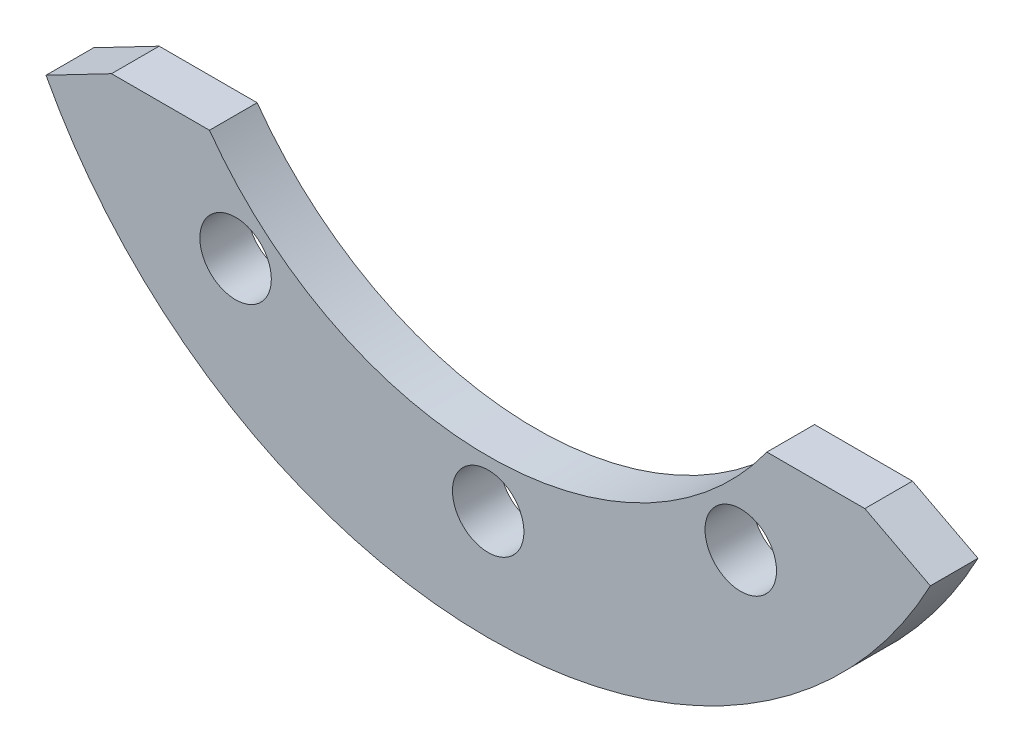
ISO-10303-21;
HEADER;
FILE_DESCRIPTION(('STEP AP214'),'2;1');
FILE_NAME('part.step','',(''),(''),'','','');
FILE_SCHEMA(('AUTOMOTIVE_DESIGN { 1 0 10303 214 1 1 1 1 }'));
ENDSEC;
DATA;
#1=APPLICATION_CONTEXT('core data for automotive mechanical design processes');
#2=APPLICATION_PROTOCOL_DEFINITION('international standard','automotive_design',2000,#1);
#3=PRODUCT_CONTEXT('',#1,'mechanical');
#4=PRODUCT('Part','Part','',(#3));
#5=PRODUCT_RELATED_PRODUCT_CATEGORY('part','',(#4));
#6=PRODUCT_DEFINITION_FORMATION('','',#4);
#7=PRODUCT_DEFINITION_CONTEXT('part definition',#1,'design');
#8=PRODUCT_DEFINITION('design','',#6,#7);
#9=PRODUCT_DEFINITION_SHAPE('','',#8);
#10=(LENGTH_UNIT() NAMED_UNIT(*) SI_UNIT(.MILLI.,.METRE.));
#11=(NAMED_UNIT(*) PLANE_ANGLE_UNIT() SI_UNIT($,.RADIAN.));
#12=(NAMED_UNIT(*) SI_UNIT($,.STERADIAN.) SOLID_ANGLE_UNIT());
#13=UNCERTAINTY_MEASURE_WITH_UNIT(LENGTH_MEASURE(1.E-05),#10,'distance_accuracy_value','');
#14=(GEOMETRIC_REPRESENTATION_CONTEXT(3) GLOBAL_UNCERTAINTY_ASSIGNED_CONTEXT((#13)) GLOBAL_UNIT_ASSIGNED_CONTEXT((#10,
#11,#12)) REPRESENTATION_CONTEXT('',''));
#15=CARTESIAN_POINT('',(0.,0.,0.));
#16=DIRECTION('',(0.,0.,1.));
#17=DIRECTION('',(1.,0.,0.));
#18=AXIS2_PLACEMENT_3D('',#15,#16,#17);
#19=CARTESIAN_POINT('',(5.84807660688538,-4.2,-1.));
#20=DIRECTION('',(0.,1.,0.));
#21=DIRECTION('',(0.,0.,1.));
#22=AXIS2_PLACEMENT_3D('',#19,#20,#21);
#23=PLANE('',#22);
#24=DIRECTION('',(-1.,0.,0.));
#25=VECTOR('',#24,1.);
#26=CARTESIAN_POINT('',(5.84807660688538,-4.2,0.));
#27=LINE('',#26,#25);
#28=CARTESIAN_POINT('',(7.90332208631282,-4.2,0.));
#29=VERTEX_POINT('',#28);
#30=CARTESIAN_POINT('',(5.84807660688538,-4.2,0.));
#31=VERTEX_POINT('',#30);
#32=EDGE_CURVE('E99',#29,#31,#27,.T.);
#33=ORIENTED_EDGE('',*,*,#32,.F.);
#34=DIRECTION('',(0.,0.,1.));
#35=VECTOR('',#34,1.);
#36=CARTESIAN_POINT('',(7.90332208631282,-4.2,-1.));
#37=LINE('',#36,#35);
#38=CARTESIAN_POINT('',(7.90332208631282,-4.2,-1.));
#39=VERTEX_POINT('',#38);
#40=EDGE_CURVE('E49',#39,#29,#37,.T.);
#41=ORIENTED_EDGE('',*,*,#40,.F.);
#42=DIRECTION('',(-1.,0.,0.));
#43=VECTOR('',#42,1.);
#44=CARTESIAN_POINT('',(5.84807660688538,-4.2,-1.));
#45=LINE('',#44,#43);
#46=CARTESIAN_POINT('',(5.84807660688538,-4.2,-1.));
#47=VERTEX_POINT('',#46);
#48=EDGE_CURVE('E97',#39,#47,#45,.T.);
#49=ORIENTED_EDGE('',*,*,#48,.T.);
#50=DIRECTION('',(0.,0.,1.));
#51=VECTOR('',#50,1.);
#52=CARTESIAN_POINT('',(5.84807660688538,-4.2,-1.));
#53=LINE('',#52,#51);
#54=EDGE_CURVE('E11',#47,#31,#53,.T.);
#55=ORIENTED_EDGE('',*,*,#54,.T.);
#56=EDGE_LOOP('',(#33,#41,#49,#55));
#57=FACE_BOUND('',#56,.T.);
#58=ADVANCED_FACE('F34',(#57),#23,.T.);
#59=CARTESIAN_POINT('',(0.,0.,-1.));
#60=DIRECTION('',(0.,0.,1.));
#61=DIRECTION('',(1.,0.,0.));
#62=AXIS2_PLACEMENT_3D('',#59,#60,#61);
#63=CYLINDRICAL_SURFACE('',#62,10.5);
#64=CARTESIAN_POINT('',(0.,0.,-1.));
#65=DIRECTION('',(0.,0.,1.));
#66=DIRECTION('',(1.,0.,0.));
#67=AXIS2_PLACEMENT_3D('',#64,#65,#66);
#68=CIRCLE('',#67,10.5);
#69=CARTESIAN_POINT('',(-9.27823124000227,-4.91573240291271,-1.));
#70=VERTEX_POINT('',#69);
#71=CARTESIAN_POINT('',(9.27823124000227,-4.91573240291271,-1.));
#72=VERTEX_POINT('',#71);
#73=EDGE_CURVE('E106',#70,#72,#68,.T.);
#74=ORIENTED_EDGE('',*,*,#73,.T.);
#75=DIRECTION('',(0.,0.,1.));
#76=VECTOR('',#75,1.);
#77=CARTESIAN_POINT('',(9.27823124000227,-4.91573240291271,-1.));
#78=LINE('',#77,#76);
#79=CARTESIAN_POINT('',(9.27823124000227,-4.91573240291271,0.));
#80=VERTEX_POINT('',#79);
#81=EDGE_CURVE('E88',#72,#80,#78,.T.);
#82=ORIENTED_EDGE('',*,*,#81,.T.);
#83=CARTESIAN_POINT('',(0.,0.,0.));
#84=DIRECTION('',(0.,0.,1.));
#85=DIRECTION('',(1.,0.,0.));
#86=AXIS2_PLACEMENT_3D('',#83,#84,#85);
#87=CIRCLE('',#86,10.5);
#88=CARTESIAN_POINT('',(-9.27823124000227,-4.91573240291271,0.));
#89=VERTEX_POINT('',#88);
#90=EDGE_CURVE('E119',#89,#80,#87,.T.);
#91=ORIENTED_EDGE('',*,*,#90,.F.);
#92=DIRECTION('',(0.,0.,1.));
#93=VECTOR('',#92,1.);
#94=CARTESIAN_POINT('',(-9.27823124000227,-4.91573240291271,-1.));
#95=LINE('',#94,#93);
#96=EDGE_CURVE('E57',#70,#89,#95,.T.);
#97=ORIENTED_EDGE('',*,*,#96,.F.);
#98=EDGE_LOOP('',(#74,#82,#91,#97));
#99=FACE_BOUND('',#98,.T.);
#100=ADVANCED_FACE('F157',(#99),#63,.T.);
#101=CARTESIAN_POINT('',(0.,0.,-1.));
#102=DIRECTION('',(0.,0.,1.));
#103=DIRECTION('',(1.,0.,0.));
#104=AXIS2_PLACEMENT_3D('',#101,#102,#103);
#105=PLANE('',#104);
#106=CARTESIAN_POINT('',(5.3,-6.25699608438426,-1.));
#107=DIRECTION('',(0.,0.,1.));
#108=DIRECTION('',(1.,0.,0.));
#109=AXIS2_PLACEMENT_3D('',#106,#107,#108);
#110=CIRCLE('',#109,0.75);
#111=CARTESIAN_POINT('',(6.05,-6.25699608438426,-1.));
#112=VERTEX_POINT('',#111);
#113=EDGE_CURVE('E116',#112,#112,#110,.T.);
#114=ORIENTED_EDGE('',*,*,#113,.T.);
#115=EDGE_LOOP('',(#114));
#116=FACE_BOUND('',#115,.T.);
#117=CARTESIAN_POINT('',(-5.3,-6.25699608438426,-1.));
#118=DIRECTION('',(0.,0.,1.));
#119=DIRECTION('',(1.,0.,0.));
#120=AXIS2_PLACEMENT_3D('',#117,#118,#119);
#121=CIRCLE('',#120,0.75);
#122=CARTESIAN_POINT('',(-4.55,-6.25699608438426,-1.));
#123=VERTEX_POINT('',#122);
#124=EDGE_CURVE('E132',#123,#123,#121,.T.);
#125=ORIENTED_EDGE('',*,*,#124,.T.);
#126=EDGE_LOOP('',(#125));
#127=FACE_BOUND('',#126,.T.);
#128=CARTESIAN_POINT('',(0.,-8.2,-1.));
#129=DIRECTION('',(0.,0.,1.));
#130=DIRECTION('',(1.,0.,0.));
#131=AXIS2_PLACEMENT_3D('',#128,#129,#130);
#132=CIRCLE('',#131,0.75);
#133=CARTESIAN_POINT('',(0.75,-8.2,-1.));
#134=VERTEX_POINT('',#133);
#135=EDGE_CURVE('E138',#134,#134,#132,.T.);
#136=ORIENTED_EDGE('',*,*,#135,.T.);
#137=EDGE_LOOP('',(#136));
#138=FACE_BOUND('',#137,.T.);
#139=DIRECTION('',(-0.887010833178223,0.461748613235031,0.));
#140=VECTOR('',#139,1.);
#141=CARTESIAN_POINT('',(7.90332208631282,-4.2,-1.));
#142=LINE('',#141,#140);
#143=EDGE_CURVE('E85',#72,#39,#142,.T.);
#144=ORIENTED_EDGE('',*,*,#143,.F.);
#145=ORIENTED_EDGE('',*,*,#73,.F.);
#146=DIRECTION('',(0.887010833178223,0.461748613235031,0.));
#147=VECTOR('',#146,1.);
#148=CARTESIAN_POINT('',(-7.90332208631282,-4.2,-1.));
#149=LINE('',#148,#147);
#150=CARTESIAN_POINT('',(-7.90332208631282,-4.2,-1.));
#151=VERTEX_POINT('',#150);
#152=EDGE_CURVE('E146',#70,#151,#149,.T.);
#153=ORIENTED_EDGE('',*,*,#152,.T.);
#154=DIRECTION('',(-1.,0.,0.));
#155=VECTOR('',#154,1.);
#156=CARTESIAN_POINT('',(-9.62340895940726,-4.2,-1.));
#157=LINE('',#156,#155);
#158=CARTESIAN_POINT('',(-5.84807660688538,-4.2,-1.));
#159=VERTEX_POINT('',#158);
#160=EDGE_CURVE('E108',#159,#151,#157,.T.);
#161=ORIENTED_EDGE('',*,*,#160,.F.);
#162=CARTESIAN_POINT('',(0.,0.,-1.));
#163=DIRECTION('',(0.,0.,-1.));
#164=DIRECTION('',(1.,0.,0.));
#165=AXIS2_PLACEMENT_3D('',#162,#163,#164);
#166=CIRCLE('',#165,7.2);
#167=EDGE_CURVE('E105',#47,#159,#166,.T.);
#168=ORIENTED_EDGE('',*,*,#167,.F.);
#169=ORIENTED_EDGE('',*,*,#48,.F.);
#170=EDGE_LOOP('',(#144,#145,#153,#161,#168,#169));
#171=FACE_BOUND('',#170,.T.);
#172=ADVANCED_FACE('F102',(#116,#127,#138,#171),#105,.F.);
#173=CARTESIAN_POINT('',(0.,0.,0.));
#174=DIRECTION('',(0.,0.,1.));
#175=DIRECTION('',(1.,0.,0.));
#176=AXIS2_PLACEMENT_3D('',#173,#174,#175);
#177=PLANE('',#176);
#178=CARTESIAN_POINT('',(0.,-8.2,0.));
#179=DIRECTION('',(0.,0.,1.));
#180=DIRECTION('',(1.,0.,0.));
#181=AXIS2_PLACEMENT_3D('',#178,#179,#180);
#182=CIRCLE('',#181,0.75);
#183=CARTESIAN_POINT('',(0.75,-8.2,0.));
#184=VERTEX_POINT('',#183);
#185=EDGE_CURVE('E141',#184,#184,#182,.T.);
#186=ORIENTED_EDGE('',*,*,#185,.F.);
#187=EDGE_LOOP('',(#186));
#188=FACE_BOUND('',#187,.T.);
#189=CARTESIAN_POINT('',(-5.3,-6.25699608438426,0.));
#190=DIRECTION('',(0.,0.,1.));
#191=DIRECTION('',(1.,0.,0.));
#192=AXIS2_PLACEMENT_3D('',#189,#190,#191);
#193=CIRCLE('',#192,0.75);
#194=CARTESIAN_POINT('',(-4.55,-6.25699608438426,0.));
#195=VERTEX_POINT('',#194);
#196=EDGE_CURVE('E135',#195,#195,#193,.T.);
#197=ORIENTED_EDGE('',*,*,#196,.F.);
#198=EDGE_LOOP('',(#197));
#199=FACE_BOUND('',#198,.T.);
#200=CARTESIAN_POINT('',(5.3,-6.25699608438426,0.));
#201=DIRECTION('',(0.,0.,1.));
#202=DIRECTION('',(1.,0.,0.));
#203=AXIS2_PLACEMENT_3D('',#200,#201,#202);
#204=CIRCLE('',#203,0.75);
#205=CARTESIAN_POINT('',(6.05,-6.25699608438426,0.));
#206=VERTEX_POINT('',#205);
#207=EDGE_CURVE('E129',#206,#206,#204,.T.);
#208=ORIENTED_EDGE('',*,*,#207,.F.);
#209=EDGE_LOOP('',(#208));
#210=FACE_BOUND('',#209,.T.);
#211=ORIENTED_EDGE('',*,*,#90,.T.);
#212=DIRECTION('',(-0.887010833178223,0.461748613235031,0.));
#213=VECTOR('',#212,1.);
#214=CARTESIAN_POINT('',(7.90332208631282,-4.2,0.));
#215=LINE('',#214,#213);
#216=EDGE_CURVE('E93',#80,#29,#215,.T.);
#217=ORIENTED_EDGE('',*,*,#216,.T.);
#218=ORIENTED_EDGE('',*,*,#32,.T.);
#219=CARTESIAN_POINT('',(0.,0.,0.));
#220=DIRECTION('',(0.,0.,-1.));
#221=DIRECTION('',(1.,0.,0.));
#222=AXIS2_PLACEMENT_3D('',#219,#220,#221);
#223=CIRCLE('',#222,7.2);
#224=CARTESIAN_POINT('',(-5.84807660688538,-4.2,0.));
#225=VERTEX_POINT('',#224);
#226=EDGE_CURVE('E112',#31,#225,#223,.T.);
#227=ORIENTED_EDGE('',*,*,#226,.T.);
#228=DIRECTION('',(-1.,0.,0.));
#229=VECTOR('',#228,1.);
#230=CARTESIAN_POINT('',(-9.62340895940726,-4.2,0.));
#231=LINE('',#230,#229);
#232=CARTESIAN_POINT('',(-7.90332208631282,-4.2,0.));
#233=VERTEX_POINT('',#232);
#234=EDGE_CURVE('E115',#225,#233,#231,.T.);
#235=ORIENTED_EDGE('',*,*,#234,.T.);
#236=DIRECTION('',(0.887010833178223,0.461748613235031,0.));
#237=VECTOR('',#236,1.);
#238=CARTESIAN_POINT('',(-7.90332208631282,-4.2,0.));
#239=LINE('',#238,#237);
#240=EDGE_CURVE('E149',#89,#233,#239,.T.);
#241=ORIENTED_EDGE('',*,*,#240,.F.);
#242=EDGE_LOOP('',(#211,#217,#218,#227,#235,#241));
#243=FACE_BOUND('',#242,.T.);
#244=ADVANCED_FACE('F154',(#188,#199,#210,#243),#177,.T.);
#245=CARTESIAN_POINT('',(0.,0.,-1.));
#246=DIRECTION('',(0.,0.,1.));
#247=DIRECTION('',(1.,0.,0.));
#248=AXIS2_PLACEMENT_3D('',#245,#246,#247);
#249=CYLINDRICAL_SURFACE('',#248,7.2);
#250=ORIENTED_EDGE('',*,*,#226,.F.);
#251=ORIENTED_EDGE('',*,*,#54,.F.);
#252=ORIENTED_EDGE('',*,*,#167,.T.);
#253=DIRECTION('',(0.,0.,1.));
#254=VECTOR('',#253,1.);
#255=CARTESIAN_POINT('',(-5.84807660688538,-4.2,-1.));
#256=LINE('',#255,#254);
#257=EDGE_CURVE('E38',#159,#225,#256,.T.);
#258=ORIENTED_EDGE('',*,*,#257,.T.);
#259=EDGE_LOOP('',(#250,#251,#252,#258));
#260=FACE_BOUND('',#259,.T.);
#261=ADVANCED_FACE('F36',(#260),#249,.F.);
#262=CARTESIAN_POINT('',(-9.62340895940726,-4.2,-1.));
#263=DIRECTION('',(0.,1.,0.));
#264=DIRECTION('',(0.,0.,1.));
#265=AXIS2_PLACEMENT_3D('',#262,#263,#264);
#266=PLANE('',#265);
#267=DIRECTION('',(0.,0.,1.));
#268=VECTOR('',#267,1.);
#269=CARTESIAN_POINT('',(-7.90332208631282,-4.2,-1.));
#270=LINE('',#269,#268);
#271=EDGE_CURVE('E144',#151,#233,#270,.T.);
#272=ORIENTED_EDGE('',*,*,#271,.T.);
#273=ORIENTED_EDGE('',*,*,#234,.F.);
#274=ORIENTED_EDGE('',*,*,#257,.F.);
#275=ORIENTED_EDGE('',*,*,#160,.T.);
#276=EDGE_LOOP('',(#272,#273,#274,#275));
#277=FACE_BOUND('',#276,.T.);
#278=ADVANCED_FACE('F159',(#277),#266,.T.);
#279=CARTESIAN_POINT('',(5.3,-6.25699608438426,0.));
#280=DIRECTION('',(0.,0.,1.));
#281=DIRECTION('',(1.,0.,0.));
#282=AXIS2_PLACEMENT_3D('',#279,#280,#281);
#283=CYLINDRICAL_SURFACE('',#282,0.75);
#284=ORIENTED_EDGE('',*,*,#113,.F.);
#285=EDGE_LOOP('',(#284));
#286=FACE_BOUND('',#285,.T.);
#287=ORIENTED_EDGE('',*,*,#207,.T.);
#288=EDGE_LOOP('',(#287));
#289=FACE_BOUND('',#288,.T.);
#290=ADVANCED_FACE('F183',(#286,#289),#283,.F.);
#291=CARTESIAN_POINT('',(-5.3,-6.25699608438426,0.));
#292=DIRECTION('',(0.,0.,1.));
#293=DIRECTION('',(1.,0.,0.));
#294=AXIS2_PLACEMENT_3D('',#291,#292,#293);
#295=CYLINDRICAL_SURFACE('',#294,0.75);
#296=ORIENTED_EDGE('',*,*,#124,.F.);
#297=EDGE_LOOP('',(#296));
#298=FACE_BOUND('',#297,.T.);
#299=ORIENTED_EDGE('',*,*,#196,.T.);
#300=EDGE_LOOP('',(#299));
#301=FACE_BOUND('',#300,.T.);
#302=ADVANCED_FACE('F171',(#298,#301),#295,.F.);
#303=CARTESIAN_POINT('',(0.,-8.2,0.));
#304=DIRECTION('',(0.,0.,1.));
#305=DIRECTION('',(1.,0.,0.));
#306=AXIS2_PLACEMENT_3D('',#303,#304,#305);
#307=CYLINDRICAL_SURFACE('',#306,0.75);
#308=ORIENTED_EDGE('',*,*,#135,.F.);
#309=EDGE_LOOP('',(#308));
#310=FACE_BOUND('',#309,.T.);
#311=ORIENTED_EDGE('',*,*,#185,.T.);
#312=EDGE_LOOP('',(#311));
#313=FACE_BOUND('',#312,.T.);
#314=ADVANCED_FACE('F164',(#310,#313),#307,.F.);
#315=CARTESIAN_POINT('',(-7.90332208631282,-4.2,-1.));
#316=DIRECTION('',(0.461748613235031,-0.887010833178223,0.));
#317=DIRECTION('',(0.887010833178223,0.461748613235031,0.));
#318=AXIS2_PLACEMENT_3D('',#315,#316,#317);
#319=PLANE('',#318);
#320=ORIENTED_EDGE('',*,*,#240,.T.);
#321=ORIENTED_EDGE('',*,*,#271,.F.);
#322=ORIENTED_EDGE('',*,*,#152,.F.);
#323=ORIENTED_EDGE('',*,*,#96,.T.);
#324=EDGE_LOOP('',(#320,#321,#322,#323));
#325=FACE_BOUND('',#324,.T.);
#326=ADVANCED_FACE('F162',(#325),#319,.F.);
#327=CARTESIAN_POINT('',(7.90332208631282,-4.2,-1.));
#328=DIRECTION('',(0.461748613235031,0.887010833178223,0.));
#329=DIRECTION('',(-0.887010833178223,0.461748613235031,0.));
#330=AXIS2_PLACEMENT_3D('',#327,#328,#329);
#331=PLANE('',#330);
#332=ORIENTED_EDGE('',*,*,#216,.F.);
#333=ORIENTED_EDGE('',*,*,#81,.F.);
#334=ORIENTED_EDGE('',*,*,#143,.T.);
#335=ORIENTED_EDGE('',*,*,#40,.T.);
#336=EDGE_LOOP('',(#332,#333,#334,#335));
#337=FACE_BOUND('',#336,.T.);
#338=ADVANCED_FACE('F86',(#337),#331,.T.);
#339=CLOSED_SHELL('',(#58,#100,#172,#244,#261,#278,#290,#302,#314,#326,#338));
#340=MANIFOLD_SOLID_BREP('B2',#339);
#341=ADVANCED_BREP_SHAPE_REPRESENTATION('',(#18,#340),#14);
#342=SHAPE_DEFINITION_REPRESENTATION(#9,#341);
ENDSEC;
END-ISO-10303-21;
